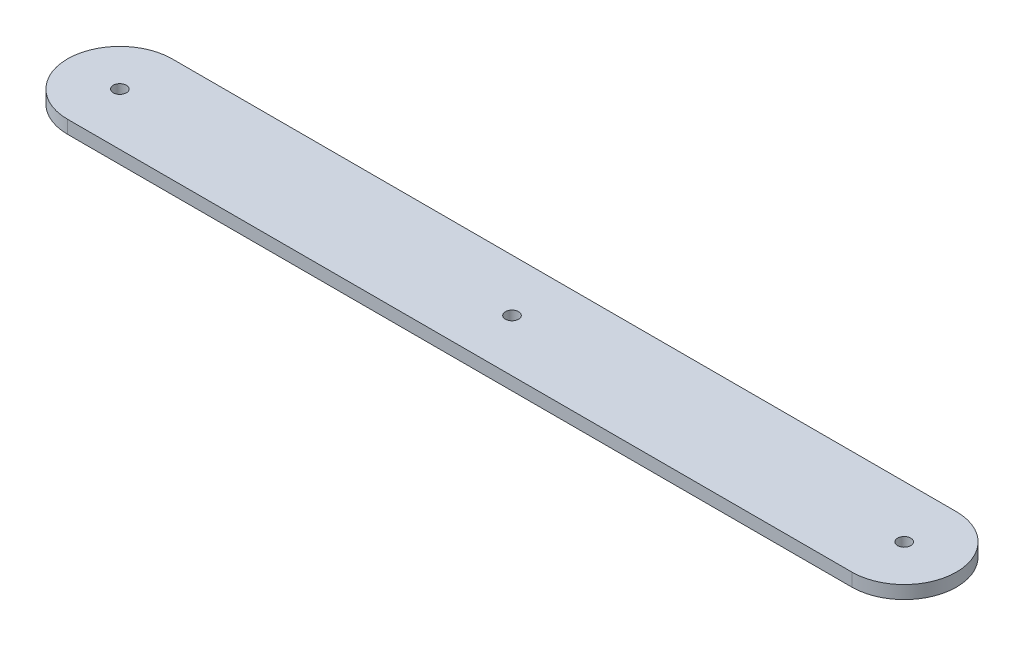
ISO-10303-21;
HEADER;
FILE_DESCRIPTION(('STEP AP214'),'2;1');
FILE_NAME('part.step','',(''),(''),'','','');
FILE_SCHEMA(('AUTOMOTIVE_DESIGN { 1 0 10303 214 1 1 1 1 }'));
ENDSEC;
DATA;
#1=APPLICATION_CONTEXT('core data for automotive mechanical design processes');
#2=APPLICATION_PROTOCOL_DEFINITION('international standard','automotive_design',2000,#1);
#3=PRODUCT_CONTEXT('',#1,'mechanical');
#4=PRODUCT('Part','Part','',(#3));
#5=PRODUCT_RELATED_PRODUCT_CATEGORY('part','',(#4));
#6=PRODUCT_DEFINITION_FORMATION('','',#4);
#7=PRODUCT_DEFINITION_CONTEXT('part definition',#1,'design');
#8=PRODUCT_DEFINITION('design','',#6,#7);
#9=PRODUCT_DEFINITION_SHAPE('','',#8);
#10=(LENGTH_UNIT() NAMED_UNIT(*) SI_UNIT(.MILLI.,.METRE.));
#11=(NAMED_UNIT(*) PLANE_ANGLE_UNIT() SI_UNIT($,.RADIAN.));
#12=(NAMED_UNIT(*) SI_UNIT($,.STERADIAN.) SOLID_ANGLE_UNIT());
#13=UNCERTAINTY_MEASURE_WITH_UNIT(LENGTH_MEASURE(1.E-05),#10,'distance_accuracy_value','');
#14=(GEOMETRIC_REPRESENTATION_CONTEXT(3) GLOBAL_UNCERTAINTY_ASSIGNED_CONTEXT((#13)) GLOBAL_UNIT_ASSIGNED_CONTEXT((#10,
#11,#12)) REPRESENTATION_CONTEXT('',''));
#15=CARTESIAN_POINT('',(0.,0.,0.));
#16=DIRECTION('',(0.,0.,1.));
#17=DIRECTION('',(1.,0.,0.));
#18=AXIS2_PLACEMENT_3D('',#15,#16,#17);
#19=CARTESIAN_POINT('',(-95.25,3.175,0.));
#20=DIRECTION('',(0.,-1.,0.));
#21=DIRECTION('',(0.,0.,-1.));
#22=AXIS2_PLACEMENT_3D('',#19,#20,#21);
#23=CYLINDRICAL_SURFACE('',#22,12.7);
#24=CARTESIAN_POINT('',(-95.25,0.,0.));
#25=DIRECTION('',(0.,1.,0.));
#26=DIRECTION('',(0.,0.,1.));
#27=AXIS2_PLACEMENT_3D('',#24,#25,#26);
#28=CIRCLE('',#27,12.7);
#29=CARTESIAN_POINT('',(-95.25,0.,-12.7));
#30=VERTEX_POINT('',#29);
#31=CARTESIAN_POINT('',(-95.25,0.,12.7));
#32=VERTEX_POINT('',#31);
#33=EDGE_CURVE('E96',#30,#32,#28,.T.);
#34=ORIENTED_EDGE('',*,*,#33,.T.);
#35=DIRECTION('',(0.,-1.,0.));
#36=VECTOR('',#35,1.);
#37=CARTESIAN_POINT('',(-95.25,3.175,12.7));
#38=LINE('',#37,#36);
#39=CARTESIAN_POINT('',(-95.25,3.175,12.7));
#40=VERTEX_POINT('',#39);
#41=EDGE_CURVE('E11',#40,#32,#38,.T.);
#42=ORIENTED_EDGE('',*,*,#41,.F.);
#43=CARTESIAN_POINT('',(-95.25,3.175,0.));
#44=DIRECTION('',(0.,1.,0.));
#45=DIRECTION('',(0.,0.,1.));
#46=AXIS2_PLACEMENT_3D('',#43,#44,#45);
#47=CIRCLE('',#46,12.7);
#48=CARTESIAN_POINT('',(-95.25,3.175,-12.7));
#49=VERTEX_POINT('',#48);
#50=EDGE_CURVE('E84',#49,#40,#47,.T.);
#51=ORIENTED_EDGE('',*,*,#50,.F.);
#52=DIRECTION('',(0.,-1.,0.));
#53=VECTOR('',#52,1.);
#54=CARTESIAN_POINT('',(-95.25,3.175,-12.7));
#55=LINE('',#54,#53);
#56=EDGE_CURVE('E92',#49,#30,#55,.T.);
#57=ORIENTED_EDGE('',*,*,#56,.T.);
#58=EDGE_LOOP('',(#34,#42,#51,#57));
#59=FACE_BOUND('',#58,.T.);
#60=ADVANCED_FACE('F33',(#59),#23,.T.);
#61=CARTESIAN_POINT('',(-95.25,3.175,12.7));
#62=DIRECTION('',(0.,0.,-1.));
#63=DIRECTION('',(-1.,0.,0.));
#64=AXIS2_PLACEMENT_3D('',#61,#62,#63);
#65=PLANE('',#64);
#66=DIRECTION('',(1.,0.,0.));
#67=VECTOR('',#66,1.);
#68=CARTESIAN_POINT('',(-95.25,0.,12.7));
#69=LINE('',#68,#67);
#70=CARTESIAN_POINT('',(95.25,0.,12.7));
#71=VERTEX_POINT('',#70);
#72=EDGE_CURVE('E88',#32,#71,#69,.T.);
#73=ORIENTED_EDGE('',*,*,#72,.T.);
#74=DIRECTION('',(0.,-1.,0.));
#75=VECTOR('',#74,1.);
#76=CARTESIAN_POINT('',(95.25,3.175,12.7));
#77=LINE('',#76,#75);
#78=CARTESIAN_POINT('',(95.25,3.175,12.7));
#79=VERTEX_POINT('',#78);
#80=EDGE_CURVE('E41',#79,#71,#77,.T.);
#81=ORIENTED_EDGE('',*,*,#80,.F.);
#82=DIRECTION('',(1.,0.,0.));
#83=VECTOR('',#82,1.);
#84=CARTESIAN_POINT('',(-95.25,3.175,12.7));
#85=LINE('',#84,#83);
#86=EDGE_CURVE('E79',#40,#79,#85,.T.);
#87=ORIENTED_EDGE('',*,*,#86,.F.);
#88=ORIENTED_EDGE('',*,*,#41,.T.);
#89=EDGE_LOOP('',(#73,#81,#87,#88));
#90=FACE_BOUND('',#89,.T.);
#91=ADVANCED_FACE('F87',(#90),#65,.F.);
#92=CARTESIAN_POINT('',(95.25,3.175,0.));
#93=DIRECTION('',(0.,-1.,0.));
#94=DIRECTION('',(0.,0.,-1.));
#95=AXIS2_PLACEMENT_3D('',#92,#93,#94);
#96=CYLINDRICAL_SURFACE('',#95,12.7);
#97=CARTESIAN_POINT('',(95.25,0.,0.));
#98=DIRECTION('',(0.,1.,0.));
#99=DIRECTION('',(0.,0.,1.));
#100=AXIS2_PLACEMENT_3D('',#97,#98,#99);
#101=CIRCLE('',#100,12.7);
#102=CARTESIAN_POINT('',(95.25,0.,-12.7000000000001));
#103=VERTEX_POINT('',#102);
#104=EDGE_CURVE('E66',#71,#103,#101,.T.);
#105=ORIENTED_EDGE('',*,*,#104,.T.);
#106=DIRECTION('',(0.,-1.,0.));
#107=VECTOR('',#106,1.);
#108=CARTESIAN_POINT('',(95.25,3.175,-12.7000000000001));
#109=LINE('',#108,#107);
#110=CARTESIAN_POINT('',(95.25,3.175,-12.7000000000001));
#111=VERTEX_POINT('',#110);
#112=EDGE_CURVE('E89',#111,#103,#109,.T.);
#113=ORIENTED_EDGE('',*,*,#112,.F.);
#114=CARTESIAN_POINT('',(95.25,3.175,0.));
#115=DIRECTION('',(0.,1.,0.));
#116=DIRECTION('',(0.,0.,1.));
#117=AXIS2_PLACEMENT_3D('',#114,#115,#116);
#118=CIRCLE('',#117,12.7);
#119=EDGE_CURVE('E82',#79,#111,#118,.T.);
#120=ORIENTED_EDGE('',*,*,#119,.F.);
#121=ORIENTED_EDGE('',*,*,#80,.T.);
#122=EDGE_LOOP('',(#105,#113,#120,#121));
#123=FACE_BOUND('',#122,.T.);
#124=ADVANCED_FACE('F90',(#123),#96,.T.);
#125=CARTESIAN_POINT('',(-95.25,3.175,-12.7));
#126=DIRECTION('',(0.,0.,1.));
#127=DIRECTION('',(1.,0.,0.));
#128=AXIS2_PLACEMENT_3D('',#125,#126,#127);
#129=PLANE('',#128);
#130=DIRECTION('',(-1.,0.,0.));
#131=VECTOR('',#130,1.);
#132=CARTESIAN_POINT('',(-95.25,0.,-12.7));
#133=LINE('',#132,#131);
#134=EDGE_CURVE('E72',#103,#30,#133,.T.);
#135=ORIENTED_EDGE('',*,*,#134,.T.);
#136=ORIENTED_EDGE('',*,*,#56,.F.);
#137=DIRECTION('',(-1.,0.,0.));
#138=VECTOR('',#137,1.);
#139=CARTESIAN_POINT('',(-95.25,3.175,-12.7));
#140=LINE('',#139,#138);
#141=EDGE_CURVE('E49',#111,#49,#140,.T.);
#142=ORIENTED_EDGE('',*,*,#141,.F.);
#143=ORIENTED_EDGE('',*,*,#112,.T.);
#144=EDGE_LOOP('',(#135,#136,#142,#143));
#145=FACE_BOUND('',#144,.T.);
#146=ADVANCED_FACE('F104',(#145),#129,.F.);
#147=CARTESIAN_POINT('',(-95.25,3.175,0.));
#148=DIRECTION('',(0.,1.,0.));
#149=DIRECTION('',(0.,0.,1.));
#150=AXIS2_PLACEMENT_3D('',#147,#148,#149);
#151=PLANE('',#150);
#152=CARTESIAN_POINT('',(-95.25,3.175,0.));
#153=DIRECTION('',(0.,1.,0.));
#154=DIRECTION('',(0.,0.,1.));
#155=AXIS2_PLACEMENT_3D('',#152,#153,#154);
#156=CIRCLE('',#155,1.6);
#157=CARTESIAN_POINT('',(-95.25,3.175,1.60000000000003));
#158=VERTEX_POINT('',#157);
#159=EDGE_CURVE('E124',#158,#158,#156,.T.);
#160=ORIENTED_EDGE('',*,*,#159,.F.);
#161=EDGE_LOOP('',(#160));
#162=FACE_BOUND('',#161,.T.);
#163=CARTESIAN_POINT('',(0.,3.175,0.));
#164=DIRECTION('',(0.,1.,0.));
#165=DIRECTION('',(0.,0.,1.));
#166=AXIS2_PLACEMENT_3D('',#163,#164,#165);
#167=CIRCLE('',#166,1.6);
#168=CARTESIAN_POINT('',(0.,3.175,1.6));
#169=VERTEX_POINT('',#168);
#170=EDGE_CURVE('E118',#169,#169,#167,.T.);
#171=ORIENTED_EDGE('',*,*,#170,.F.);
#172=EDGE_LOOP('',(#171));
#173=FACE_BOUND('',#172,.T.);
#174=CARTESIAN_POINT('',(95.25,3.175,0.));
#175=DIRECTION('',(0.,1.,0.));
#176=DIRECTION('',(0.,0.,1.));
#177=AXIS2_PLACEMENT_3D('',#174,#175,#176);
#178=CIRCLE('',#177,1.6);
#179=CARTESIAN_POINT('',(95.25,3.175,1.59999999999997));
#180=VERTEX_POINT('',#179);
#181=EDGE_CURVE('E112',#180,#180,#178,.T.);
#182=ORIENTED_EDGE('',*,*,#181,.F.);
#183=EDGE_LOOP('',(#182));
#184=FACE_BOUND('',#183,.T.);
#185=ORIENTED_EDGE('',*,*,#50,.T.);
#186=ORIENTED_EDGE('',*,*,#86,.T.);
#187=ORIENTED_EDGE('',*,*,#119,.T.);
#188=ORIENTED_EDGE('',*,*,#141,.T.);
#189=EDGE_LOOP('',(#185,#186,#187,#188));
#190=FACE_BOUND('',#189,.T.);
#191=ADVANCED_FACE('F80',(#162,#173,#184,#190),#151,.T.);
#192=CARTESIAN_POINT('',(-95.25,0.,0.));
#193=DIRECTION('',(0.,1.,0.));
#194=DIRECTION('',(0.,0.,1.));
#195=AXIS2_PLACEMENT_3D('',#192,#193,#194);
#196=PLANE('',#195);
#197=CARTESIAN_POINT('',(-95.25,0.,0.));
#198=DIRECTION('',(0.,1.,0.));
#199=DIRECTION('',(0.,0.,1.));
#200=AXIS2_PLACEMENT_3D('',#197,#198,#199);
#201=CIRCLE('',#200,1.6);
#202=CARTESIAN_POINT('',(-95.25,0.,1.60000000000003));
#203=VERTEX_POINT('',#202);
#204=EDGE_CURVE('E121',#203,#203,#201,.T.);
#205=ORIENTED_EDGE('',*,*,#204,.T.);
#206=EDGE_LOOP('',(#205));
#207=FACE_BOUND('',#206,.T.);
#208=CARTESIAN_POINT('',(0.,0.,0.));
#209=DIRECTION('',(0.,1.,0.));
#210=DIRECTION('',(0.,0.,1.));
#211=AXIS2_PLACEMENT_3D('',#208,#209,#210);
#212=CIRCLE('',#211,1.6);
#213=CARTESIAN_POINT('',(0.,0.,1.6));
#214=VERTEX_POINT('',#213);
#215=EDGE_CURVE('E115',#214,#214,#212,.T.);
#216=ORIENTED_EDGE('',*,*,#215,.T.);
#217=EDGE_LOOP('',(#216));
#218=FACE_BOUND('',#217,.T.);
#219=CARTESIAN_POINT('',(95.25,0.,0.));
#220=DIRECTION('',(0.,1.,0.));
#221=DIRECTION('',(0.,0.,1.));
#222=AXIS2_PLACEMENT_3D('',#219,#220,#221);
#223=CIRCLE('',#222,1.6);
#224=CARTESIAN_POINT('',(95.25,0.,1.59999999999997));
#225=VERTEX_POINT('',#224);
#226=EDGE_CURVE('E99',#225,#225,#223,.T.);
#227=ORIENTED_EDGE('',*,*,#226,.T.);
#228=EDGE_LOOP('',(#227));
#229=FACE_BOUND('',#228,.T.);
#230=ORIENTED_EDGE('',*,*,#33,.F.);
#231=ORIENTED_EDGE('',*,*,#134,.F.);
#232=ORIENTED_EDGE('',*,*,#104,.F.);
#233=ORIENTED_EDGE('',*,*,#72,.F.);
#234=EDGE_LOOP('',(#230,#231,#232,#233));
#235=FACE_BOUND('',#234,.T.);
#236=ADVANCED_FACE('F107',(#207,#218,#229,#235),#196,.F.);
#237=CARTESIAN_POINT('',(95.25,3.175,0.));
#238=DIRECTION('',(0.,1.,0.));
#239=DIRECTION('',(0.,0.,1.));
#240=AXIS2_PLACEMENT_3D('',#237,#238,#239);
#241=CYLINDRICAL_SURFACE('',#240,1.6);
#242=ORIENTED_EDGE('',*,*,#226,.F.);
#243=EDGE_LOOP('',(#242));
#244=FACE_BOUND('',#243,.T.);
#245=ORIENTED_EDGE('',*,*,#181,.T.);
#246=EDGE_LOOP('',(#245));
#247=FACE_BOUND('',#246,.T.);
#248=ADVANCED_FACE('F137',(#244,#247),#241,.F.);
#249=CARTESIAN_POINT('',(0.,3.175,0.));
#250=DIRECTION('',(0.,1.,0.));
#251=DIRECTION('',(0.,0.,1.));
#252=AXIS2_PLACEMENT_3D('',#249,#250,#251);
#253=CYLINDRICAL_SURFACE('',#252,1.6);
#254=ORIENTED_EDGE('',*,*,#215,.F.);
#255=EDGE_LOOP('',(#254));
#256=FACE_BOUND('',#255,.T.);
#257=ORIENTED_EDGE('',*,*,#170,.T.);
#258=EDGE_LOOP('',(#257));
#259=FACE_BOUND('',#258,.T.);
#260=ADVANCED_FACE('F139',(#256,#259),#253,.F.);
#261=CARTESIAN_POINT('',(-95.25,3.175,0.));
#262=DIRECTION('',(0.,1.,0.));
#263=DIRECTION('',(0.,0.,1.));
#264=AXIS2_PLACEMENT_3D('',#261,#262,#263);
#265=CYLINDRICAL_SURFACE('',#264,1.6);
#266=ORIENTED_EDGE('',*,*,#204,.F.);
#267=EDGE_LOOP('',(#266));
#268=FACE_BOUND('',#267,.T.);
#269=ORIENTED_EDGE('',*,*,#159,.T.);
#270=EDGE_LOOP('',(#269));
#271=FACE_BOUND('',#270,.T.);
#272=ADVANCED_FACE('F128',(#268,#271),#265,.F.);
#273=CLOSED_SHELL('',(#60,#91,#124,#146,#191,#236,#248,#260,#272));
#274=MANIFOLD_SOLID_BREP('B2',#273);
#275=ADVANCED_BREP_SHAPE_REPRESENTATION('',(#18,#274),#14);
#276=SHAPE_DEFINITION_REPRESENTATION(#9,#275);
ENDSEC;
END-ISO-10303-21;
